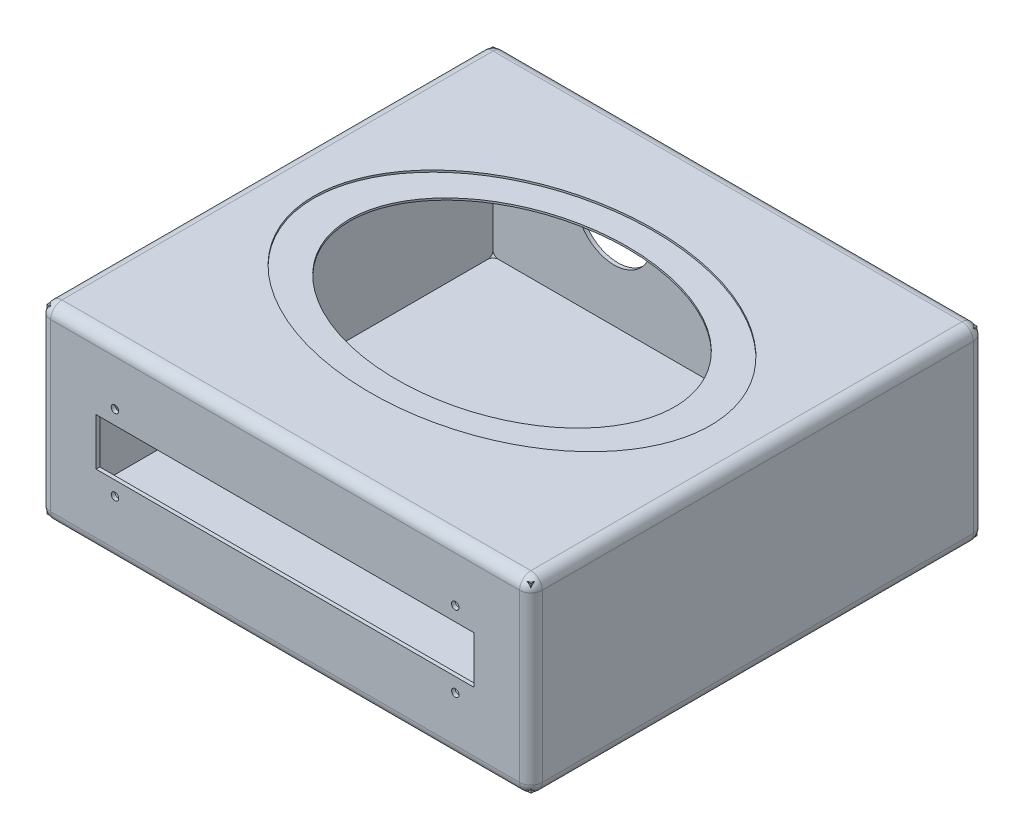
ISO-10303-21;
HEADER;
FILE_DESCRIPTION(('STEP AP214'),'2;1');
FILE_NAME('part.step','',(''),(''),'','','');
FILE_SCHEMA(('AUTOMOTIVE_DESIGN { 1 0 10303 214 1 1 1 1 }'));
ENDSEC;
DATA;
#1=APPLICATION_CONTEXT('core data for automotive mechanical design processes');
#2=APPLICATION_PROTOCOL_DEFINITION('international standard','automotive_design',2000,#1);
#3=PRODUCT_CONTEXT('',#1,'mechanical');
#4=PRODUCT('Part','Part','',(#3));
#5=PRODUCT_RELATED_PRODUCT_CATEGORY('part','',(#4));
#6=PRODUCT_DEFINITION_FORMATION('','',#4);
#7=PRODUCT_DEFINITION_CONTEXT('part definition',#1,'design');
#8=PRODUCT_DEFINITION('design','',#6,#7);
#9=PRODUCT_DEFINITION_SHAPE('','',#8);
#10=(LENGTH_UNIT() NAMED_UNIT(*) SI_UNIT(.MILLI.,.METRE.));
#11=(NAMED_UNIT(*) PLANE_ANGLE_UNIT() SI_UNIT($,.RADIAN.));
#12=(NAMED_UNIT(*) SI_UNIT($,.STERADIAN.) SOLID_ANGLE_UNIT());
#13=UNCERTAINTY_MEASURE_WITH_UNIT(LENGTH_MEASURE(1.E-05),#10,'distance_accuracy_value','');
#14=(GEOMETRIC_REPRESENTATION_CONTEXT(3) GLOBAL_UNCERTAINTY_ASSIGNED_CONTEXT((#13)) GLOBAL_UNIT_ASSIGNED_CONTEXT((#10,
#11,#12)) REPRESENTATION_CONTEXT('',''));
#15=CARTESIAN_POINT('',(0.,0.,0.));
#16=DIRECTION('',(0.,0.,1.));
#17=DIRECTION('',(1.,0.,0.));
#18=AXIS2_PLACEMENT_3D('',#15,#16,#17);
#19=CARTESIAN_POINT('',(114.3,38.1,149.86));
#20=DIRECTION('',(0.,0.,1.));
#21=DIRECTION('',(1.,0.,0.));
#22=AXIS2_PLACEMENT_3D('',#19,#20,#21);
#23=CYLINDRICAL_SURFACE('',#22,2.5);
#24=CARTESIAN_POINT('',(114.3,38.1,149.86));
#25=DIRECTION('',(0.,0.,1.));
#26=DIRECTION('',(1.,0.,0.));
#27=AXIS2_PLACEMENT_3D('',#24,#25,#26);
#28=CIRCLE('',#27,2.5);
#29=CARTESIAN_POINT('',(116.8,38.1,149.86));
#30=VERTEX_POINT('',#29);
#31=EDGE_CURVE('E47',#30,#30,#28,.T.);
#32=ORIENTED_EDGE('',*,*,#31,.F.);
#33=EDGE_LOOP('',(#32));
#34=FACE_BOUND('',#33,.T.);
#35=CARTESIAN_POINT('',(114.3,38.1,152.4));
#36=DIRECTION('',(0.,0.,1.));
#37=DIRECTION('',(1.,0.,0.));
#38=AXIS2_PLACEMENT_3D('',#35,#36,#37);
#39=CIRCLE('',#38,2.5);
#40=CARTESIAN_POINT('',(116.8,38.1,152.4));
#41=VERTEX_POINT('',#40);
#42=EDGE_CURVE('E12',#41,#41,#39,.T.);
#43=ORIENTED_EDGE('',*,*,#42,.T.);
#44=EDGE_LOOP('',(#43));
#45=FACE_BOUND('',#44,.T.);
#46=ADVANCED_FACE('F40',(#34,#45),#23,.F.);
#47=CARTESIAN_POINT('',(-114.3,38.1,149.86));
#48=DIRECTION('',(0.,0.,1.));
#49=DIRECTION('',(1.,0.,0.));
#50=AXIS2_PLACEMENT_3D('',#47,#48,#49);
#51=CYLINDRICAL_SURFACE('',#50,2.5);
#52=CARTESIAN_POINT('',(-114.3,38.1,149.86));
#53=DIRECTION('',(0.,0.,1.));
#54=DIRECTION('',(1.,0.,0.));
#55=AXIS2_PLACEMENT_3D('',#52,#53,#54);
#56=CIRCLE('',#55,2.5);
#57=CARTESIAN_POINT('',(-111.8,38.1,149.86));
#58=VERTEX_POINT('',#57);
#59=EDGE_CURVE('E375',#58,#58,#56,.T.);
#60=ORIENTED_EDGE('',*,*,#59,.F.);
#61=EDGE_LOOP('',(#60));
#62=FACE_BOUND('',#61,.T.);
#63=CARTESIAN_POINT('',(-114.3,38.1,152.4));
#64=DIRECTION('',(0.,0.,1.));
#65=DIRECTION('',(1.,0.,0.));
#66=AXIS2_PLACEMENT_3D('',#63,#64,#65);
#67=CIRCLE('',#66,2.5);
#68=CARTESIAN_POINT('',(-111.8,38.1,152.4));
#69=VERTEX_POINT('',#68);
#70=EDGE_CURVE('E385',#69,#69,#67,.T.);
#71=ORIENTED_EDGE('',*,*,#70,.T.);
#72=EDGE_LOOP('',(#71));
#73=FACE_BOUND('',#72,.T.);
#74=ADVANCED_FACE('F394',(#62,#73),#51,.F.);
#75=CARTESIAN_POINT('',(0.,101.6,0.));
#76=DIRECTION('',(0.,1.,0.));
#77=DIRECTION('',(-1.,0.,0.));
#78=AXIS2_PLACEMENT_3D('',#75,#76,#77);
#79=ELLIPSE('',#78,109.22,77.47);
#80=DIRECTION('',(0.,1.,0.));
#81=VECTOR('',#80,1.);
#82=SURFACE_OF_LINEAR_EXTRUSION('',#79,#81);
#83=CARTESIAN_POINT('',(0.,124.46,0.));
#84=DIRECTION('',(0.,1.,0.));
#85=DIRECTION('',(-1.,0.,0.));
#86=AXIS2_PLACEMENT_3D('',#83,#84,#85);
#87=ELLIPSE('',#86,109.22,77.47);
#88=CARTESIAN_POINT('',(-109.22,124.46,0.));
#89=VERTEX_POINT('',#88);
#90=EDGE_CURVE('E376',#89,#89,#87,.F.);
#91=ORIENTED_EDGE('',*,*,#90,.T.);
#92=EDGE_LOOP('',(#91));
#93=FACE_BOUND('',#92,.T.);
#94=CARTESIAN_POINT('',(0.,125.73,0.));
#95=DIRECTION('',(0.,1.,0.));
#96=DIRECTION('',(-1.,0.,0.));
#97=AXIS2_PLACEMENT_3D('',#94,#95,#96);
#98=ELLIPSE('',#97,109.22,77.47);
#99=CARTESIAN_POINT('',(-109.22,125.73,0.));
#100=VERTEX_POINT('',#99);
#101=EDGE_CURVE('E379',#100,#100,#98,.F.);
#102=ORIENTED_EDGE('',*,*,#101,.F.);
#103=EDGE_LOOP('',(#102));
#104=FACE_BOUND('',#103,.T.);
#105=ADVANCED_FACE('F422',(#93,#104),#82,.F.);
#106=CARTESIAN_POINT('',(165.1,127.,152.4));
#107=DIRECTION('',(-1.,0.,0.));
#108=DIRECTION('',(0.,0.,1.));
#109=AXIS2_PLACEMENT_3D('',#106,#107,#108);
#110=PLANE('',#109);
#111=DIRECTION('',(0.,-1.,0.));
#112=VECTOR('',#111,1.);
#113=CARTESIAN_POINT('',(165.1,127.,144.78));
#114=LINE('',#113,#112);
#115=CARTESIAN_POINT('',(165.1,119.38,144.78));
#116=VERTEX_POINT('',#115);
#117=CARTESIAN_POINT('',(165.1,7.62,144.78));
#118=VERTEX_POINT('',#117);
#119=EDGE_CURVE('E283',#116,#118,#114,.T.);
#120=ORIENTED_EDGE('',*,*,#119,.T.);
#121=DIRECTION('',(0.,0.,-1.));
#122=VECTOR('',#121,1.);
#123=CARTESIAN_POINT('',(165.1,7.62,-152.4));
#124=LINE('',#123,#122);
#125=CARTESIAN_POINT('',(165.1,7.62,-144.78));
#126=VERTEX_POINT('',#125);
#127=EDGE_CURVE('E286',#118,#126,#124,.T.);
#128=ORIENTED_EDGE('',*,*,#127,.T.);
#129=DIRECTION('',(0.,-1.,0.));
#130=VECTOR('',#129,1.);
#131=CARTESIAN_POINT('',(165.1,127.,-144.78));
#132=LINE('',#131,#130);
#133=CARTESIAN_POINT('',(165.1,119.38,-144.78));
#134=VERTEX_POINT('',#133);
#135=EDGE_CURVE('E281',#126,#134,#132,.F.);
#136=ORIENTED_EDGE('',*,*,#135,.T.);
#137=DIRECTION('',(0.,0.,-1.));
#138=VECTOR('',#137,1.);
#139=CARTESIAN_POINT('',(165.1,119.38,152.4));
#140=LINE('',#139,#138);
#141=EDGE_CURVE('E279',#134,#116,#140,.F.);
#142=ORIENTED_EDGE('',*,*,#141,.T.);
#143=EDGE_LOOP('',(#120,#128,#136,#142));
#144=FACE_BOUND('',#143,.T.);
#145=ADVANCED_FACE('F418',(#144),#110,.F.);
#146=CARTESIAN_POINT('',(-165.1,127.,-152.4));
#147=DIRECTION('',(0.,0.,1.));
#148=DIRECTION('',(1.,0.,0.));
#149=AXIS2_PLACEMENT_3D('',#146,#147,#148);
#150=PLANE('',#149);
#151=CARTESIAN_POINT('',(127.,50.8,-152.4));
#152=DIRECTION('',(0.,0.,-1.));
#153=DIRECTION('',(-1.,0.,0.));
#154=AXIS2_PLACEMENT_3D('',#151,#152,#153);
#155=CIRCLE('',#154,11.);
#156=CARTESIAN_POINT('',(116.,50.8,-152.4));
#157=VERTEX_POINT('',#156);
#158=EDGE_CURVE('E202',#157,#157,#155,.T.);
#159=ORIENTED_EDGE('',*,*,#158,.F.);
#160=EDGE_LOOP('',(#159));
#161=FACE_BOUND('',#160,.T.);
#162=CARTESIAN_POINT('',(-81.28,63.5,-152.4));
#163=DIRECTION('',(0.,0.,-1.));
#164=DIRECTION('',(-1.,0.,0.));
#165=AXIS2_PLACEMENT_3D('',#162,#163,#164);
#166=CIRCLE('',#165,25.4);
#167=CARTESIAN_POINT('',(-106.68,63.5,-152.4));
#168=VERTEX_POINT('',#167);
#169=EDGE_CURVE('E208',#168,#168,#166,.T.);
#170=ORIENTED_EDGE('',*,*,#169,.F.);
#171=EDGE_LOOP('',(#170));
#172=FACE_BOUND('',#171,.T.);
#173=DIRECTION('',(0.,-1.,0.));
#174=VECTOR('',#173,1.);
#175=CARTESIAN_POINT('',(157.48,127.,-152.4));
#176=LINE('',#175,#174);
#177=CARTESIAN_POINT('',(157.48,119.38,-152.4));
#178=VERTEX_POINT('',#177);
#179=CARTESIAN_POINT('',(157.48,7.62,-152.4));
#180=VERTEX_POINT('',#179);
#181=EDGE_CURVE('E245',#178,#180,#176,.T.);
#182=ORIENTED_EDGE('',*,*,#181,.T.);
#183=DIRECTION('',(-1.,0.,0.));
#184=VECTOR('',#183,1.);
#185=CARTESIAN_POINT('',(-165.1,7.62,-152.4));
#186=LINE('',#185,#184);
#187=CARTESIAN_POINT('',(-157.48,7.62,-152.4));
#188=VERTEX_POINT('',#187);
#189=EDGE_CURVE('E249',#180,#188,#186,.T.);
#190=ORIENTED_EDGE('',*,*,#189,.T.);
#191=DIRECTION('',(0.,-1.,0.));
#192=VECTOR('',#191,1.);
#193=CARTESIAN_POINT('',(-157.48,127.,-152.4));
#194=LINE('',#193,#192);
#195=CARTESIAN_POINT('',(-157.48,119.38,-152.4));
#196=VERTEX_POINT('',#195);
#197=EDGE_CURVE('E247',#188,#196,#194,.F.);
#198=ORIENTED_EDGE('',*,*,#197,.T.);
#199=DIRECTION('',(-1.,0.,0.));
#200=VECTOR('',#199,1.);
#201=CARTESIAN_POINT('',(-165.1,119.38,-152.4));
#202=LINE('',#201,#200);
#203=EDGE_CURVE('E214',#196,#178,#202,.F.);
#204=ORIENTED_EDGE('',*,*,#203,.T.);
#205=EDGE_LOOP('',(#182,#190,#198,#204));
#206=FACE_BOUND('',#205,.T.);
#207=ADVANCED_FACE('F409',(#161,#172,#206),#150,.F.);
#208=CARTESIAN_POINT('',(-165.1,127.,152.4));
#209=DIRECTION('',(1.,0.,0.));
#210=DIRECTION('',(0.,0.,-1.));
#211=AXIS2_PLACEMENT_3D('',#208,#209,#210);
#212=PLANE('',#211);
#213=DIRECTION('',(0.,-1.,0.));
#214=VECTOR('',#213,1.);
#215=CARTESIAN_POINT('',(-165.1,127.,-144.78));
#216=LINE('',#215,#214);
#217=CARTESIAN_POINT('',(-165.1,119.38,-144.78));
#218=VERTEX_POINT('',#217);
#219=CARTESIAN_POINT('',(-165.1,7.62,-144.78));
#220=VERTEX_POINT('',#219);
#221=EDGE_CURVE('E274',#218,#220,#216,.T.);
#222=ORIENTED_EDGE('',*,*,#221,.T.);
#223=DIRECTION('',(0.,0.,1.));
#224=VECTOR('',#223,1.);
#225=CARTESIAN_POINT('',(-165.1,7.62,152.4));
#226=LINE('',#225,#224);
#227=CARTESIAN_POINT('',(-165.1,7.62,144.78));
#228=VERTEX_POINT('',#227);
#229=EDGE_CURVE('E277',#220,#228,#226,.T.);
#230=ORIENTED_EDGE('',*,*,#229,.T.);
#231=DIRECTION('',(0.,-1.,0.));
#232=VECTOR('',#231,1.);
#233=CARTESIAN_POINT('',(-165.1,127.,144.78));
#234=LINE('',#233,#232);
#235=CARTESIAN_POINT('',(-165.1,119.38,144.78));
#236=VERTEX_POINT('',#235);
#237=EDGE_CURVE('E272',#228,#236,#234,.F.);
#238=ORIENTED_EDGE('',*,*,#237,.T.);
#239=DIRECTION('',(0.,0.,1.));
#240=VECTOR('',#239,1.);
#241=CARTESIAN_POINT('',(-165.1,119.38,152.4));
#242=LINE('',#241,#240);
#243=EDGE_CURVE('E270',#236,#218,#242,.F.);
#244=ORIENTED_EDGE('',*,*,#243,.T.);
#245=EDGE_LOOP('',(#222,#230,#238,#244));
#246=FACE_BOUND('',#245,.T.);
#247=ADVANCED_FACE('F399',(#246),#212,.F.);
#248=CARTESIAN_POINT('',(-165.1,127.,152.4));
#249=DIRECTION('',(0.,0.,-1.));
#250=DIRECTION('',(-1.,0.,0.));
#251=AXIS2_PLACEMENT_3D('',#248,#249,#250);
#252=PLANE('',#251);
#253=CARTESIAN_POINT('',(114.3,88.9,152.4));
#254=DIRECTION('',(0.,0.,1.));
#255=DIRECTION('',(1.,0.,0.));
#256=AXIS2_PLACEMENT_3D('',#253,#254,#255);
#257=CIRCLE('',#256,2.5);
#258=CARTESIAN_POINT('',(116.8,88.9,152.4));
#259=VERTEX_POINT('',#258);
#260=EDGE_CURVE('E562',#259,#259,#257,.T.);
#261=ORIENTED_EDGE('',*,*,#260,.F.);
#262=EDGE_LOOP('',(#261));
#263=FACE_BOUND('',#262,.T.);
#264=CARTESIAN_POINT('',(-114.3,88.9,152.4));
#265=DIRECTION('',(0.,0.,1.));
#266=DIRECTION('',(1.,0.,0.));
#267=AXIS2_PLACEMENT_3D('',#264,#265,#266);
#268=CIRCLE('',#267,2.5);
#269=CARTESIAN_POINT('',(-111.8,88.9,152.4));
#270=VERTEX_POINT('',#269);
#271=EDGE_CURVE('E559',#270,#270,#268,.T.);
#272=ORIENTED_EDGE('',*,*,#271,.F.);
#273=EDGE_LOOP('',(#272));
#274=FACE_BOUND('',#273,.T.);
#275=DIRECTION('',(-1.,0.,0.));
#276=VECTOR('',#275,1.);
#277=CARTESIAN_POINT('',(-127.,79.375,152.4));
#278=LINE('',#277,#276);
#279=CARTESIAN_POINT('',(127.,79.375,152.4));
#280=VERTEX_POINT('',#279);
#281=CARTESIAN_POINT('',(-127.,79.375,152.4));
#282=VERTEX_POINT('',#281);
#283=EDGE_CURVE('E188',#280,#282,#278,.T.);
#284=ORIENTED_EDGE('',*,*,#283,.F.);
#285=DIRECTION('',(0.,1.,0.));
#286=VECTOR('',#285,1.);
#287=CARTESIAN_POINT('',(127.,47.625,152.4));
#288=LINE('',#287,#286);
#289=CARTESIAN_POINT('',(127.,47.625,152.4));
#290=VERTEX_POINT('',#289);
#291=EDGE_CURVE('E54',#290,#280,#288,.T.);
#292=ORIENTED_EDGE('',*,*,#291,.F.);
#293=DIRECTION('',(1.,0.,0.));
#294=VECTOR('',#293,1.);
#295=CARTESIAN_POINT('',(-127.,47.625,152.4));
#296=LINE('',#295,#294);
#297=CARTESIAN_POINT('',(-127.,47.625,152.4));
#298=VERTEX_POINT('',#297);
#299=EDGE_CURVE('E195',#298,#290,#296,.T.);
#300=ORIENTED_EDGE('',*,*,#299,.F.);
#301=DIRECTION('',(0.,-1.,0.));
#302=VECTOR('',#301,1.);
#303=CARTESIAN_POINT('',(-127.,47.625,152.4));
#304=LINE('',#303,#302);
#305=EDGE_CURVE('E179',#282,#298,#304,.T.);
#306=ORIENTED_EDGE('',*,*,#305,.F.);
#307=EDGE_LOOP('',(#284,#292,#300,#306));
#308=FACE_BOUND('',#307,.T.);
#309=DIRECTION('',(0.,-1.,0.));
#310=VECTOR('',#309,1.);
#311=CARTESIAN_POINT('',(-157.48,127.,152.4));
#312=LINE('',#311,#310);
#313=CARTESIAN_POINT('',(-157.48,119.38,152.4));
#314=VERTEX_POINT('',#313);
#315=CARTESIAN_POINT('',(-157.48,7.62,152.4));
#316=VERTEX_POINT('',#315);
#317=EDGE_CURVE('E265',#314,#316,#312,.T.);
#318=ORIENTED_EDGE('',*,*,#317,.T.);
#319=DIRECTION('',(1.,0.,0.));
#320=VECTOR('',#319,1.);
#321=CARTESIAN_POINT('',(165.1,7.62,152.4));
#322=LINE('',#321,#320);
#323=CARTESIAN_POINT('',(157.48,7.62,152.4));
#324=VERTEX_POINT('',#323);
#325=EDGE_CURVE('E267',#316,#324,#322,.T.);
#326=ORIENTED_EDGE('',*,*,#325,.T.);
#327=DIRECTION('',(0.,-1.,0.));
#328=VECTOR('',#327,1.);
#329=CARTESIAN_POINT('',(157.48,127.,152.4));
#330=LINE('',#329,#328);
#331=CARTESIAN_POINT('',(157.48,119.38,152.4));
#332=VERTEX_POINT('',#331);
#333=EDGE_CURVE('E263',#324,#332,#330,.F.);
#334=ORIENTED_EDGE('',*,*,#333,.T.);
#335=DIRECTION('',(1.,0.,0.));
#336=VECTOR('',#335,1.);
#337=CARTESIAN_POINT('',(-165.1,119.38,152.4));
#338=LINE('',#337,#336);
#339=EDGE_CURVE('E261',#332,#314,#338,.F.);
#340=ORIENTED_EDGE('',*,*,#339,.T.);
#341=EDGE_LOOP('',(#318,#326,#334,#340));
#342=FACE_BOUND('',#341,.T.);
#343=ORIENTED_EDGE('',*,*,#70,.F.);
#344=EDGE_LOOP('',(#343));
#345=FACE_BOUND('',#344,.T.);
#346=ORIENTED_EDGE('',*,*,#42,.F.);
#347=EDGE_LOOP('',(#346));
#348=FACE_BOUND('',#347,.T.);
#349=ADVANCED_FACE('F192',(#263,#274,#308,#342,#345,#348),#252,.F.);
#350=CARTESIAN_POINT('',(0.,127.,0.));
#351=DIRECTION('',(0.,-1.,0.));
#352=DIRECTION('',(0.,0.,-1.));
#353=AXIS2_PLACEMENT_3D('',#350,#351,#352);
#354=PLANE('',#353);
#355=CARTESIAN_POINT('',(0.,127.,0.));
#356=DIRECTION('',(0.,1.,0.));
#357=DIRECTION('',(-1.,0.,0.));
#358=AXIS2_PLACEMENT_3D('',#355,#356,#357);
#359=ELLIPSE('',#358,133.35,95.25);
#360=CARTESIAN_POINT('',(-133.35,127.,0.));
#361=VERTEX_POINT('',#360);
#362=EDGE_CURVE('E553',#361,#361,#359,.T.);
#363=ORIENTED_EDGE('',*,*,#362,.F.);
#364=EDGE_LOOP('',(#363));
#365=FACE_BOUND('',#364,.T.);
#366=DIRECTION('',(0.,0.,1.));
#367=VECTOR('',#366,1.);
#368=CARTESIAN_POINT('',(-157.48,127.,0.));
#369=LINE('',#368,#367);
#370=CARTESIAN_POINT('',(-157.48,127.,-144.78));
#371=VERTEX_POINT('',#370);
#372=CARTESIAN_POINT('',(-157.48,127.,144.78));
#373=VERTEX_POINT('',#372);
#374=EDGE_CURVE('E292',#371,#373,#369,.T.);
#375=ORIENTED_EDGE('',*,*,#374,.T.);
#376=DIRECTION('',(1.,0.,0.));
#377=VECTOR('',#376,1.);
#378=CARTESIAN_POINT('',(0.,127.,144.78));
#379=LINE('',#378,#377);
#380=CARTESIAN_POINT('',(157.48,127.,144.78));
#381=VERTEX_POINT('',#380);
#382=EDGE_CURVE('E294',#373,#381,#379,.T.);
#383=ORIENTED_EDGE('',*,*,#382,.T.);
#384=DIRECTION('',(0.,0.,-1.));
#385=VECTOR('',#384,1.);
#386=CARTESIAN_POINT('',(157.48,127.,0.));
#387=LINE('',#386,#385);
#388=CARTESIAN_POINT('',(157.48,127.,-144.78));
#389=VERTEX_POINT('',#388);
#390=EDGE_CURVE('E288',#381,#389,#387,.T.);
#391=ORIENTED_EDGE('',*,*,#390,.T.);
#392=DIRECTION('',(-1.,0.,0.));
#393=VECTOR('',#392,1.);
#394=CARTESIAN_POINT('',(0.,127.,-144.78));
#395=LINE('',#394,#393);
#396=EDGE_CURVE('E290',#389,#371,#395,.T.);
#397=ORIENTED_EDGE('',*,*,#396,.T.);
#398=EDGE_LOOP('',(#375,#383,#391,#397));
#399=FACE_BOUND('',#398,.T.);
#400=ADVANCED_FACE('F398',(#365,#399),#354,.F.);
#401=CARTESIAN_POINT('',(0.,0.,0.));
#402=DIRECTION('',(0.,-1.,0.));
#403=DIRECTION('',(0.,0.,-1.));
#404=AXIS2_PLACEMENT_3D('',#401,#402,#403);
#405=PLANE('',#404);
#406=DIRECTION('',(1.,0.,0.));
#407=VECTOR('',#406,1.);
#408=CARTESIAN_POINT('',(-165.1,0.,144.78));
#409=LINE('',#408,#407);
#410=CARTESIAN_POINT('',(157.48,0.,144.78));
#411=VERTEX_POINT('',#410);
#412=CARTESIAN_POINT('',(-157.48,0.,144.78));
#413=VERTEX_POINT('',#412);
#414=EDGE_CURVE('E254',#411,#413,#409,.F.);
#415=ORIENTED_EDGE('',*,*,#414,.T.);
#416=DIRECTION('',(0.,0.,1.));
#417=VECTOR('',#416,1.);
#418=CARTESIAN_POINT('',(-157.48,0.,-152.4));
#419=LINE('',#418,#417);
#420=CARTESIAN_POINT('',(-157.48,0.,-144.78));
#421=VERTEX_POINT('',#420);
#422=EDGE_CURVE('E259',#413,#421,#419,.F.);
#423=ORIENTED_EDGE('',*,*,#422,.T.);
#424=DIRECTION('',(-1.,0.,0.));
#425=VECTOR('',#424,1.);
#426=CARTESIAN_POINT('',(165.1,0.,-144.78));
#427=LINE('',#426,#425);
#428=CARTESIAN_POINT('',(157.48,0.,-144.78));
#429=VERTEX_POINT('',#428);
#430=EDGE_CURVE('E256',#421,#429,#427,.F.);
#431=ORIENTED_EDGE('',*,*,#430,.T.);
#432=DIRECTION('',(0.,0.,-1.));
#433=VECTOR('',#432,1.);
#434=CARTESIAN_POINT('',(157.48,0.,152.4));
#435=LINE('',#434,#433);
#436=EDGE_CURVE('E252',#429,#411,#435,.F.);
#437=ORIENTED_EDGE('',*,*,#436,.T.);
#438=EDGE_LOOP('',(#415,#423,#431,#437));
#439=FACE_BOUND('',#438,.T.);
#440=ADVANCED_FACE('F406',(#439),#405,.T.);
#441=CARTESIAN_POINT('',(0.,119.38,144.78));
#442=DIRECTION('',(1.,0.,0.));
#443=DIRECTION('',(0.,0.,-1.));
#444=AXIS2_PLACEMENT_3D('',#441,#442,#443);
#445=CYLINDRICAL_SURFACE('',#444,7.62);
#446=CARTESIAN_POINT('',(157.48,119.38,144.78));
#447=DIRECTION('',(1.,0.,0.));
#448=DIRECTION('',(0.,0.,-1.));
#449=AXIS2_PLACEMENT_3D('',#446,#447,#448);
#450=CIRCLE('',#449,7.62);
#451=EDGE_CURVE('E243',#381,#332,#450,.T.);
#452=ORIENTED_EDGE('',*,*,#451,.F.);
#453=ORIENTED_EDGE('',*,*,#382,.F.);
#454=CARTESIAN_POINT('',(-157.48,119.38,144.78));
#455=DIRECTION('',(-1.,0.,0.));
#456=DIRECTION('',(0.,0.,1.));
#457=AXIS2_PLACEMENT_3D('',#454,#455,#456);
#458=CIRCLE('',#457,7.62);
#459=EDGE_CURVE('E360',#314,#373,#458,.T.);
#460=ORIENTED_EDGE('',*,*,#459,.F.);
#461=ORIENTED_EDGE('',*,*,#339,.F.);
#462=EDGE_LOOP('',(#452,#453,#460,#461));
#463=FACE_BOUND('',#462,.T.);
#464=ADVANCED_FACE('F524',(#463),#445,.T.);
#465=CARTESIAN_POINT('',(157.48,119.38,144.78));
#466=DIRECTION('',(0.,0.,1.));
#467=DIRECTION('',(1.,0.,0.));
#468=AXIS2_PLACEMENT_3D('',#465,#466,#467);
#469=SPHERICAL_SURFACE('',#468,7.62);
#470=CARTESIAN_POINT('',(157.48,119.38,144.78));
#471=DIRECTION('',(0.,0.,1.));
#472=DIRECTION('',(1.,0.,0.));
#473=AXIS2_PLACEMENT_3D('',#470,#471,#472);
#474=CIRCLE('',#473,7.62);
#475=EDGE_CURVE('E354',#381,#116,#474,.F.);
#476=ORIENTED_EDGE('',*,*,#475,.F.);
#477=ORIENTED_EDGE('',*,*,#451,.T.);
#478=CARTESIAN_POINT('',(157.48,119.38,144.78));
#479=DIRECTION('',(0.,1.,0.));
#480=DIRECTION('',(0.,0.,1.));
#481=AXIS2_PLACEMENT_3D('',#478,#479,#480);
#482=CIRCLE('',#481,7.62);
#483=EDGE_CURVE('E357',#116,#332,#482,.F.);
#484=ORIENTED_EDGE('',*,*,#483,.F.);
#485=EDGE_LOOP('',(#476,#477,#484));
#486=FACE_BOUND('',#485,.T.);
#487=ADVANCED_FACE('F520',(#486),#469,.T.);
#488=CARTESIAN_POINT('',(-157.48,119.38,144.78));
#489=DIRECTION('',(0.,1.,0.));
#490=DIRECTION('',(0.,0.,1.));
#491=AXIS2_PLACEMENT_3D('',#488,#489,#490);
#492=SPHERICAL_SURFACE('',#491,7.62);
#493=CARTESIAN_POINT('',(-157.48,119.38,144.78));
#494=DIRECTION('',(0.,1.,0.));
#495=DIRECTION('',(0.,0.,1.));
#496=AXIS2_PLACEMENT_3D('',#493,#494,#495);
#497=CIRCLE('',#496,7.62);
#498=EDGE_CURVE('E348',#314,#236,#497,.F.);
#499=ORIENTED_EDGE('',*,*,#498,.F.);
#500=ORIENTED_EDGE('',*,*,#459,.T.);
#501=CARTESIAN_POINT('',(-157.48,119.38,144.78));
#502=DIRECTION('',(0.,0.,1.));
#503=DIRECTION('',(1.,0.,0.));
#504=AXIS2_PLACEMENT_3D('',#501,#502,#503);
#505=CIRCLE('',#504,7.62);
#506=EDGE_CURVE('E351',#236,#373,#505,.F.);
#507=ORIENTED_EDGE('',*,*,#506,.F.);
#508=EDGE_LOOP('',(#499,#500,#507));
#509=FACE_BOUND('',#508,.T.);
#510=ADVANCED_FACE('F516',(#509),#492,.T.);
#511=CARTESIAN_POINT('',(157.48,127.,144.78));
#512=DIRECTION('',(0.,-1.,0.));
#513=DIRECTION('',(0.,0.,-1.));
#514=AXIS2_PLACEMENT_3D('',#511,#512,#513);
#515=CYLINDRICAL_SURFACE('',#514,7.62);
#516=ORIENTED_EDGE('',*,*,#483,.T.);
#517=ORIENTED_EDGE('',*,*,#333,.F.);
#518=CARTESIAN_POINT('',(157.48,7.62,144.78));
#519=DIRECTION('',(0.,-1.,0.));
#520=DIRECTION('',(0.,0.,-1.));
#521=AXIS2_PLACEMENT_3D('',#518,#519,#520);
#522=CIRCLE('',#521,7.62);
#523=EDGE_CURVE('E343',#118,#324,#522,.T.);
#524=ORIENTED_EDGE('',*,*,#523,.F.);
#525=ORIENTED_EDGE('',*,*,#119,.F.);
#526=EDGE_LOOP('',(#516,#517,#524,#525));
#527=FACE_BOUND('',#526,.T.);
#528=ADVANCED_FACE('F512',(#527),#515,.T.);
#529=CARTESIAN_POINT('',(157.48,119.38,0.));
#530=DIRECTION('',(0.,0.,-1.));
#531=DIRECTION('',(-1.,0.,0.));
#532=AXIS2_PLACEMENT_3D('',#529,#530,#531);
#533=CYLINDRICAL_SURFACE('',#532,7.62);
#534=ORIENTED_EDGE('',*,*,#475,.T.);
#535=ORIENTED_EDGE('',*,*,#141,.F.);
#536=CARTESIAN_POINT('',(157.48,119.38,-144.78));
#537=DIRECTION('',(0.,0.,-1.));
#538=DIRECTION('',(-1.,0.,0.));
#539=AXIS2_PLACEMENT_3D('',#536,#537,#538);
#540=CIRCLE('',#539,7.62);
#541=EDGE_CURVE('E340',#389,#134,#540,.T.);
#542=ORIENTED_EDGE('',*,*,#541,.F.);
#543=ORIENTED_EDGE('',*,*,#390,.F.);
#544=EDGE_LOOP('',(#534,#535,#542,#543));
#545=FACE_BOUND('',#544,.T.);
#546=ADVANCED_FACE('F508',(#545),#533,.T.);
#547=CARTESIAN_POINT('',(0.,119.38,-144.78));
#548=DIRECTION('',(-1.,0.,0.));
#549=DIRECTION('',(0.,0.,1.));
#550=AXIS2_PLACEMENT_3D('',#547,#548,#549);
#551=CYLINDRICAL_SURFACE('',#550,7.62);
#552=CARTESIAN_POINT('',(-157.48,119.38,-144.78));
#553=DIRECTION('',(-1.,0.,0.));
#554=DIRECTION('',(0.,0.,1.));
#555=AXIS2_PLACEMENT_3D('',#552,#553,#554);
#556=CIRCLE('',#555,7.62);
#557=EDGE_CURVE('E334',#371,#196,#556,.T.);
#558=ORIENTED_EDGE('',*,*,#557,.F.);
#559=ORIENTED_EDGE('',*,*,#396,.F.);
#560=CARTESIAN_POINT('',(157.48,119.38,-144.78));
#561=DIRECTION('',(1.,0.,0.));
#562=DIRECTION('',(0.,1.,0.));
#563=AXIS2_PLACEMENT_3D('',#560,#561,#562);
#564=CIRCLE('',#563,7.62);
#565=EDGE_CURVE('E337',#178,#389,#564,.T.);
#566=ORIENTED_EDGE('',*,*,#565,.F.);
#567=ORIENTED_EDGE('',*,*,#203,.F.);
#568=EDGE_LOOP('',(#558,#559,#566,#567));
#569=FACE_BOUND('',#568,.T.);
#570=ADVANCED_FACE('F504',(#569),#551,.T.);
#571=CARTESIAN_POINT('',(-157.48,119.38,0.));
#572=DIRECTION('',(0.,0.,1.));
#573=DIRECTION('',(1.,0.,0.));
#574=AXIS2_PLACEMENT_3D('',#571,#572,#573);
#575=CYLINDRICAL_SURFACE('',#574,7.62);
#576=ORIENTED_EDGE('',*,*,#506,.T.);
#577=ORIENTED_EDGE('',*,*,#374,.F.);
#578=CARTESIAN_POINT('',(-157.48,119.38,-144.78));
#579=DIRECTION('',(0.,0.,-1.));
#580=DIRECTION('',(0.,1.,0.));
#581=AXIS2_PLACEMENT_3D('',#578,#579,#580);
#582=CIRCLE('',#581,7.62);
#583=EDGE_CURVE('E331',#218,#371,#582,.T.);
#584=ORIENTED_EDGE('',*,*,#583,.F.);
#585=ORIENTED_EDGE('',*,*,#243,.F.);
#586=EDGE_LOOP('',(#576,#577,#584,#585));
#587=FACE_BOUND('',#586,.T.);
#588=ADVANCED_FACE('F500',(#587),#575,.T.);
#589=CARTESIAN_POINT('',(-157.48,127.,144.78));
#590=DIRECTION('',(0.,-1.,0.));
#591=DIRECTION('',(0.,0.,-1.));
#592=AXIS2_PLACEMENT_3D('',#589,#590,#591);
#593=CYLINDRICAL_SURFACE('',#592,7.62);
#594=ORIENTED_EDGE('',*,*,#498,.T.);
#595=ORIENTED_EDGE('',*,*,#237,.F.);
#596=CARTESIAN_POINT('',(-157.48,7.62,144.78));
#597=DIRECTION('',(0.,-1.,0.));
#598=DIRECTION('',(0.,0.,-1.));
#599=AXIS2_PLACEMENT_3D('',#596,#597,#598);
#600=CIRCLE('',#599,7.62);
#601=EDGE_CURVE('E328',#316,#228,#600,.T.);
#602=ORIENTED_EDGE('',*,*,#601,.F.);
#603=ORIENTED_EDGE('',*,*,#317,.F.);
#604=EDGE_LOOP('',(#594,#595,#602,#603));
#605=FACE_BOUND('',#604,.T.);
#606=ADVANCED_FACE('F496',(#605),#593,.T.);
#607=CARTESIAN_POINT('',(-165.1,7.62,144.78));
#608=DIRECTION('',(-1.,0.,0.));
#609=DIRECTION('',(0.,0.,1.));
#610=AXIS2_PLACEMENT_3D('',#607,#608,#609);
#611=CYLINDRICAL_SURFACE('',#610,7.62);
#612=CARTESIAN_POINT('',(157.48,7.62,144.78));
#613=DIRECTION('',(1.,0.,0.));
#614=DIRECTION('',(0.,0.,-1.));
#615=AXIS2_PLACEMENT_3D('',#612,#613,#614);
#616=CIRCLE('',#615,7.62);
#617=EDGE_CURVE('E345',#324,#411,#616,.T.);
#618=ORIENTED_EDGE('',*,*,#617,.F.);
#619=ORIENTED_EDGE('',*,*,#325,.F.);
#620=CARTESIAN_POINT('',(-157.48,7.62,144.78));
#621=DIRECTION('',(-1.,0.,0.));
#622=DIRECTION('',(0.,0.,1.));
#623=AXIS2_PLACEMENT_3D('',#620,#621,#622);
#624=CIRCLE('',#623,7.62);
#625=EDGE_CURVE('E325',#413,#316,#624,.T.);
#626=ORIENTED_EDGE('',*,*,#625,.F.);
#627=ORIENTED_EDGE('',*,*,#414,.F.);
#628=EDGE_LOOP('',(#618,#619,#626,#627));
#629=FACE_BOUND('',#628,.T.);
#630=ADVANCED_FACE('F492',(#629),#611,.T.);
#631=CARTESIAN_POINT('',(157.48,7.62,144.78));
#632=DIRECTION('',(0.,0.,1.));
#633=DIRECTION('',(0.,-1.,0.));
#634=AXIS2_PLACEMENT_3D('',#631,#632,#633);
#635=SPHERICAL_SURFACE('',#634,7.62);
#636=ORIENTED_EDGE('',*,*,#523,.T.);
#637=ORIENTED_EDGE('',*,*,#617,.T.);
#638=CARTESIAN_POINT('',(157.48,7.62,144.78));
#639=DIRECTION('',(0.,0.,1.));
#640=DIRECTION('',(1.,0.,0.));
#641=AXIS2_PLACEMENT_3D('',#638,#639,#640);
#642=CIRCLE('',#641,7.62);
#643=EDGE_CURVE('E322',#118,#411,#642,.F.);
#644=ORIENTED_EDGE('',*,*,#643,.F.);
#645=EDGE_LOOP('',(#636,#637,#644));
#646=FACE_BOUND('',#645,.T.);
#647=ADVANCED_FACE('F488',(#646),#635,.T.);
#648=CARTESIAN_POINT('',(157.48,119.38,-144.78));
#649=DIRECTION('',(0.,1.,0.));
#650=DIRECTION('',(0.,0.,1.));
#651=AXIS2_PLACEMENT_3D('',#648,#649,#650);
#652=SPHERICAL_SURFACE('',#651,7.62);
#653=ORIENTED_EDGE('',*,*,#565,.T.);
#654=ORIENTED_EDGE('',*,*,#541,.T.);
#655=CARTESIAN_POINT('',(157.48,119.38,-144.78));
#656=DIRECTION('',(0.,1.,0.));
#657=DIRECTION('',(0.,0.,1.));
#658=AXIS2_PLACEMENT_3D('',#655,#656,#657);
#659=CIRCLE('',#658,7.62);
#660=EDGE_CURVE('E319',#178,#134,#659,.F.);
#661=ORIENTED_EDGE('',*,*,#660,.F.);
#662=EDGE_LOOP('',(#653,#654,#661));
#663=FACE_BOUND('',#662,.T.);
#664=ADVANCED_FACE('F484',(#663),#652,.T.);
#665=CARTESIAN_POINT('',(-157.48,119.38,-144.78));
#666=DIRECTION('',(0.,1.,0.));
#667=DIRECTION('',(0.,0.,1.));
#668=AXIS2_PLACEMENT_3D('',#665,#666,#667);
#669=SPHERICAL_SURFACE('',#668,7.62);
#670=ORIENTED_EDGE('',*,*,#583,.T.);
#671=ORIENTED_EDGE('',*,*,#557,.T.);
#672=CARTESIAN_POINT('',(-157.48,119.38,-144.78));
#673=DIRECTION('',(0.,1.,0.));
#674=DIRECTION('',(0.,0.,1.));
#675=AXIS2_PLACEMENT_3D('',#672,#673,#674);
#676=CIRCLE('',#675,7.62);
#677=EDGE_CURVE('E316',#218,#196,#676,.F.);
#678=ORIENTED_EDGE('',*,*,#677,.F.);
#679=EDGE_LOOP('',(#670,#671,#678));
#680=FACE_BOUND('',#679,.T.);
#681=ADVANCED_FACE('F480',(#680),#669,.T.);
#682=CARTESIAN_POINT('',(-157.48,7.62,144.78));
#683=DIRECTION('',(0.,0.,1.));
#684=DIRECTION('',(0.,-1.,0.));
#685=AXIS2_PLACEMENT_3D('',#682,#683,#684);
#686=SPHERICAL_SURFACE('',#685,7.62);
#687=ORIENTED_EDGE('',*,*,#625,.T.);
#688=ORIENTED_EDGE('',*,*,#601,.T.);
#689=CARTESIAN_POINT('',(-157.48,7.62,144.78));
#690=DIRECTION('',(0.,0.,1.));
#691=DIRECTION('',(1.,0.,0.));
#692=AXIS2_PLACEMENT_3D('',#689,#690,#691);
#693=CIRCLE('',#692,7.62);
#694=EDGE_CURVE('E313',#413,#228,#693,.F.);
#695=ORIENTED_EDGE('',*,*,#694,.F.);
#696=EDGE_LOOP('',(#687,#688,#695));
#697=FACE_BOUND('',#696,.T.);
#698=ADVANCED_FACE('F476',(#697),#686,.T.);
#699=CARTESIAN_POINT('',(157.48,7.62,152.4));
#700=DIRECTION('',(0.,0.,1.));
#701=DIRECTION('',(1.,0.,0.));
#702=AXIS2_PLACEMENT_3D('',#699,#700,#701);
#703=CYLINDRICAL_SURFACE('',#702,7.62);
#704=ORIENTED_EDGE('',*,*,#643,.T.);
#705=ORIENTED_EDGE('',*,*,#436,.F.);
#706=CARTESIAN_POINT('',(157.48,7.62,-144.78));
#707=DIRECTION('',(0.,0.,-1.));
#708=DIRECTION('',(-1.,0.,0.));
#709=AXIS2_PLACEMENT_3D('',#706,#707,#708);
#710=CIRCLE('',#709,7.62);
#711=EDGE_CURVE('E310',#126,#429,#710,.T.);
#712=ORIENTED_EDGE('',*,*,#711,.F.);
#713=ORIENTED_EDGE('',*,*,#127,.F.);
#714=EDGE_LOOP('',(#704,#705,#712,#713));
#715=FACE_BOUND('',#714,.T.);
#716=ADVANCED_FACE('F472',(#715),#703,.T.);
#717=CARTESIAN_POINT('',(157.48,127.,-144.78));
#718=DIRECTION('',(0.,-1.,0.));
#719=DIRECTION('',(0.,0.,-1.));
#720=AXIS2_PLACEMENT_3D('',#717,#718,#719);
#721=CYLINDRICAL_SURFACE('',#720,7.62);
#722=ORIENTED_EDGE('',*,*,#660,.T.);
#723=ORIENTED_EDGE('',*,*,#135,.F.);
#724=CARTESIAN_POINT('',(157.48,7.62,-144.78));
#725=DIRECTION('',(0.,-1.,0.));
#726=DIRECTION('',(0.,0.,-1.));
#727=AXIS2_PLACEMENT_3D('',#724,#725,#726);
#728=CIRCLE('',#727,7.62);
#729=EDGE_CURVE('E307',#180,#126,#728,.T.);
#730=ORIENTED_EDGE('',*,*,#729,.F.);
#731=ORIENTED_EDGE('',*,*,#181,.F.);
#732=EDGE_LOOP('',(#722,#723,#730,#731));
#733=FACE_BOUND('',#732,.T.);
#734=ADVANCED_FACE('F468',(#733),#721,.T.);
#735=CARTESIAN_POINT('',(-157.48,127.,-144.78));
#736=DIRECTION('',(0.,-1.,0.));
#737=DIRECTION('',(0.,0.,-1.));
#738=AXIS2_PLACEMENT_3D('',#735,#736,#737);
#739=CYLINDRICAL_SURFACE('',#738,7.62);
#740=ORIENTED_EDGE('',*,*,#677,.T.);
#741=ORIENTED_EDGE('',*,*,#197,.F.);
#742=CARTESIAN_POINT('',(-157.48,7.62,-144.78));
#743=DIRECTION('',(0.,-1.,0.));
#744=DIRECTION('',(0.,0.,-1.));
#745=AXIS2_PLACEMENT_3D('',#742,#743,#744);
#746=CIRCLE('',#745,7.62);
#747=EDGE_CURVE('E304',#220,#188,#746,.T.);
#748=ORIENTED_EDGE('',*,*,#747,.F.);
#749=ORIENTED_EDGE('',*,*,#221,.F.);
#750=EDGE_LOOP('',(#740,#741,#748,#749));
#751=FACE_BOUND('',#750,.T.);
#752=ADVANCED_FACE('F464',(#751),#739,.T.);
#753=CARTESIAN_POINT('',(-157.48,7.62,152.4));
#754=DIRECTION('',(0.,0.,-1.));
#755=DIRECTION('',(-1.,0.,0.));
#756=AXIS2_PLACEMENT_3D('',#753,#754,#755);
#757=CYLINDRICAL_SURFACE('',#756,7.62);
#758=ORIENTED_EDGE('',*,*,#694,.T.);
#759=ORIENTED_EDGE('',*,*,#229,.F.);
#760=CARTESIAN_POINT('',(-157.48,7.62,-144.78));
#761=DIRECTION('',(0.,0.,-1.));
#762=DIRECTION('',(-1.,0.,0.));
#763=AXIS2_PLACEMENT_3D('',#760,#761,#762);
#764=CIRCLE('',#763,7.62);
#765=EDGE_CURVE('E302',#421,#220,#764,.T.);
#766=ORIENTED_EDGE('',*,*,#765,.F.);
#767=ORIENTED_EDGE('',*,*,#422,.F.);
#768=EDGE_LOOP('',(#758,#759,#766,#767));
#769=FACE_BOUND('',#768,.T.);
#770=ADVANCED_FACE('F460',(#769),#757,.T.);
#771=CARTESIAN_POINT('',(157.48,7.62,-144.78));
#772=DIRECTION('',(1.,0.,0.));
#773=DIRECTION('',(0.,1.,0.));
#774=AXIS2_PLACEMENT_3D('',#771,#772,#773);
#775=SPHERICAL_SURFACE('',#774,7.62);
#776=ORIENTED_EDGE('',*,*,#729,.T.);
#777=ORIENTED_EDGE('',*,*,#711,.T.);
#778=CARTESIAN_POINT('',(157.48,7.62,-144.78));
#779=DIRECTION('',(1.,0.,0.));
#780=DIRECTION('',(0.,0.,-1.));
#781=AXIS2_PLACEMENT_3D('',#778,#779,#780);
#782=CIRCLE('',#781,7.62);
#783=EDGE_CURVE('E300',#180,#429,#782,.F.);
#784=ORIENTED_EDGE('',*,*,#783,.F.);
#785=EDGE_LOOP('',(#776,#777,#784));
#786=FACE_BOUND('',#785,.T.);
#787=ADVANCED_FACE('F456',(#786),#775,.T.);
#788=CARTESIAN_POINT('',(-157.48,7.62,-144.78));
#789=DIRECTION('',(-1.,0.,0.));
#790=DIRECTION('',(0.,0.,1.));
#791=AXIS2_PLACEMENT_3D('',#788,#789,#790);
#792=SPHERICAL_SURFACE('',#791,7.62);
#793=ORIENTED_EDGE('',*,*,#765,.T.);
#794=ORIENTED_EDGE('',*,*,#747,.T.);
#795=CARTESIAN_POINT('',(-157.48,7.62,-144.78));
#796=DIRECTION('',(-1.,0.,0.));
#797=DIRECTION('',(0.,0.,1.));
#798=AXIS2_PLACEMENT_3D('',#795,#796,#797);
#799=CIRCLE('',#798,7.62);
#800=EDGE_CURVE('E298',#421,#188,#799,.F.);
#801=ORIENTED_EDGE('',*,*,#800,.F.);
#802=EDGE_LOOP('',(#793,#794,#801));
#803=FACE_BOUND('',#802,.T.);
#804=ADVANCED_FACE('F452',(#803),#792,.T.);
#805=CARTESIAN_POINT('',(-165.1,7.62,-144.78));
#806=DIRECTION('',(1.,0.,0.));
#807=DIRECTION('',(0.,0.,-1.));
#808=AXIS2_PLACEMENT_3D('',#805,#806,#807);
#809=CYLINDRICAL_SURFACE('',#808,7.62);
#810=ORIENTED_EDGE('',*,*,#783,.T.);
#811=ORIENTED_EDGE('',*,*,#430,.F.);
#812=ORIENTED_EDGE('',*,*,#800,.T.);
#813=ORIENTED_EDGE('',*,*,#189,.F.);
#814=EDGE_LOOP('',(#810,#811,#812,#813));
#815=FACE_BOUND('',#814,.T.);
#816=ADVANCED_FACE('F449',(#815),#809,.T.);
#817=CARTESIAN_POINT('',(-81.28,63.5,-127.));
#818=DIRECTION('',(0.,0.,-1.));
#819=DIRECTION('',(-1.,0.,0.));
#820=AXIS2_PLACEMENT_3D('',#817,#818,#819);
#821=CYLINDRICAL_SURFACE('',#820,25.4);
#822=CARTESIAN_POINT('',(-81.28,63.5,-149.86));
#823=DIRECTION('',(0.,0.,1.));
#824=DIRECTION('',(1.,0.,0.));
#825=AXIS2_PLACEMENT_3D('',#822,#823,#824);
#826=CIRCLE('',#825,25.4);
#827=CARTESIAN_POINT('',(-55.88,63.5,-149.86));
#828=VERTEX_POINT('',#827);
#829=EDGE_CURVE('E211',#828,#828,#826,.T.);
#830=ORIENTED_EDGE('',*,*,#829,.T.);
#831=EDGE_LOOP('',(#830));
#832=FACE_BOUND('',#831,.T.);
#833=ORIENTED_EDGE('',*,*,#169,.T.);
#834=EDGE_LOOP('',(#833));
#835=FACE_BOUND('',#834,.T.);
#836=ADVANCED_FACE('F428',(#832,#835),#821,.F.);
#837=CARTESIAN_POINT('',(162.56,127.,152.4));
#838=DIRECTION('',(-1.,0.,0.));
#839=DIRECTION('',(0.,0.,1.));
#840=AXIS2_PLACEMENT_3D('',#837,#838,#839);
#841=PLANE('',#840);
#842=DIRECTION('',(0.,0.,-1.));
#843=VECTOR('',#842,1.);
#844=CARTESIAN_POINT('',(162.56,2.54,0.));
#845=LINE('',#844,#843);
#846=CARTESIAN_POINT('',(162.56,2.54,149.86));
#847=VERTEX_POINT('',#846);
#848=CARTESIAN_POINT('',(162.56,2.54,-149.86));
#849=VERTEX_POINT('',#848);
#850=EDGE_CURVE('E240',#847,#849,#845,.T.);
#851=ORIENTED_EDGE('',*,*,#850,.F.);
#852=DIRECTION('',(0.,-1.,0.));
#853=VECTOR('',#852,1.);
#854=CARTESIAN_POINT('',(162.56,127.,149.86));
#855=LINE('',#854,#853);
#856=CARTESIAN_POINT('',(162.56,124.46,149.86));
#857=VERTEX_POINT('',#856);
#858=EDGE_CURVE('E237',#857,#847,#855,.T.);
#859=ORIENTED_EDGE('',*,*,#858,.F.);
#860=DIRECTION('',(0.,0.,-1.));
#861=VECTOR('',#860,1.);
#862=CARTESIAN_POINT('',(162.56,124.46,0.));
#863=LINE('',#862,#861);
#864=CARTESIAN_POINT('',(162.56,124.46,-149.86));
#865=VERTEX_POINT('',#864);
#866=EDGE_CURVE('E219',#857,#865,#863,.T.);
#867=ORIENTED_EDGE('',*,*,#866,.T.);
#868=DIRECTION('',(0.,-1.,0.));
#869=VECTOR('',#868,1.);
#870=CARTESIAN_POINT('',(162.56,127.,-149.86));
#871=LINE('',#870,#869);
#872=EDGE_CURVE('E232',#865,#849,#871,.T.);
#873=ORIENTED_EDGE('',*,*,#872,.T.);
#874=EDGE_LOOP('',(#851,#859,#867,#873));
#875=FACE_BOUND('',#874,.T.);
#876=ADVANCED_FACE('F424',(#875),#841,.T.);
#877=CARTESIAN_POINT('',(-165.1,127.,-149.86));
#878=DIRECTION('',(0.,0.,1.));
#879=DIRECTION('',(1.,0.,0.));
#880=AXIS2_PLACEMENT_3D('',#877,#878,#879);
#881=PLANE('',#880);
#882=CARTESIAN_POINT('',(127.,50.8,-149.86));
#883=DIRECTION('',(0.,0.,1.));
#884=DIRECTION('',(1.,0.,0.));
#885=AXIS2_PLACEMENT_3D('',#882,#883,#884);
#886=CIRCLE('',#885,11.);
#887=CARTESIAN_POINT('',(138.,50.8,-149.86));
#888=VERTEX_POINT('',#887);
#889=EDGE_CURVE('E207',#888,#888,#886,.T.);
#890=ORIENTED_EDGE('',*,*,#889,.F.);
#891=EDGE_LOOP('',(#890));
#892=FACE_BOUND('',#891,.T.);
#893=ORIENTED_EDGE('',*,*,#829,.F.);
#894=EDGE_LOOP('',(#893));
#895=FACE_BOUND('',#894,.T.);
#896=DIRECTION('',(-1.,0.,0.));
#897=VECTOR('',#896,1.);
#898=CARTESIAN_POINT('',(0.,2.54,-149.86));
#899=LINE('',#898,#897);
#900=CARTESIAN_POINT('',(-162.56,2.54,-149.86));
#901=VERTEX_POINT('',#900);
#902=EDGE_CURVE('E235',#849,#901,#899,.T.);
#903=ORIENTED_EDGE('',*,*,#902,.F.);
#904=ORIENTED_EDGE('',*,*,#872,.F.);
#905=DIRECTION('',(-1.,0.,0.));
#906=VECTOR('',#905,1.);
#907=CARTESIAN_POINT('',(0.,124.46,-149.86));
#908=LINE('',#907,#906);
#909=CARTESIAN_POINT('',(-162.56,124.46,-149.86));
#910=VERTEX_POINT('',#909);
#911=EDGE_CURVE('E217',#865,#910,#908,.T.);
#912=ORIENTED_EDGE('',*,*,#911,.T.);
#913=DIRECTION('',(0.,-1.,0.));
#914=VECTOR('',#913,1.);
#915=CARTESIAN_POINT('',(-162.56,127.,-149.86));
#916=LINE('',#915,#914);
#917=EDGE_CURVE('E227',#910,#901,#916,.T.);
#918=ORIENTED_EDGE('',*,*,#917,.T.);
#919=EDGE_LOOP('',(#903,#904,#912,#918));
#920=FACE_BOUND('',#919,.T.);
#921=ADVANCED_FACE('F427',(#892,#895,#920),#881,.T.);
#922=CARTESIAN_POINT('',(-162.56,127.,152.4));
#923=DIRECTION('',(1.,0.,0.));
#924=DIRECTION('',(0.,0.,-1.));
#925=AXIS2_PLACEMENT_3D('',#922,#923,#924);
#926=PLANE('',#925);
#927=DIRECTION('',(0.,0.,1.));
#928=VECTOR('',#927,1.);
#929=CARTESIAN_POINT('',(-162.56,2.54,0.));
#930=LINE('',#929,#928);
#931=CARTESIAN_POINT('',(-162.56,2.54,149.86));
#932=VERTEX_POINT('',#931);
#933=EDGE_CURVE('E230',#901,#932,#930,.T.);
#934=ORIENTED_EDGE('',*,*,#933,.F.);
#935=ORIENTED_EDGE('',*,*,#917,.F.);
#936=DIRECTION('',(0.,0.,1.));
#937=VECTOR('',#936,1.);
#938=CARTESIAN_POINT('',(-162.56,124.46,0.));
#939=LINE('',#938,#937);
#940=CARTESIAN_POINT('',(-162.56,124.46,149.86));
#941=VERTEX_POINT('',#940);
#942=EDGE_CURVE('E215',#910,#941,#939,.T.);
#943=ORIENTED_EDGE('',*,*,#942,.T.);
#944=DIRECTION('',(0.,-1.,0.));
#945=VECTOR('',#944,1.);
#946=CARTESIAN_POINT('',(-162.56,127.,149.86));
#947=LINE('',#946,#945);
#948=EDGE_CURVE('E222',#941,#932,#947,.T.);
#949=ORIENTED_EDGE('',*,*,#948,.T.);
#950=EDGE_LOOP('',(#934,#935,#943,#949));
#951=FACE_BOUND('',#950,.T.);
#952=ADVANCED_FACE('F432',(#951),#926,.T.);
#953=CARTESIAN_POINT('',(-165.1,127.,149.86));
#954=DIRECTION('',(0.,0.,-1.));
#955=DIRECTION('',(-1.,0.,0.));
#956=AXIS2_PLACEMENT_3D('',#953,#954,#955);
#957=PLANE('',#956);
#958=CARTESIAN_POINT('',(114.3,88.9,149.86));
#959=DIRECTION('',(0.,0.,1.));
#960=DIRECTION('',(1.,0.,0.));
#961=AXIS2_PLACEMENT_3D('',#958,#959,#960);
#962=CIRCLE('',#961,2.5);
#963=CARTESIAN_POINT('',(116.8,88.9,149.86));
#964=VERTEX_POINT('',#963);
#965=EDGE_CURVE('E567',#964,#964,#962,.T.);
#966=ORIENTED_EDGE('',*,*,#965,.T.);
#967=EDGE_LOOP('',(#966));
#968=FACE_BOUND('',#967,.T.);
#969=CARTESIAN_POINT('',(-114.3,88.9,149.86));
#970=DIRECTION('',(0.,0.,1.));
#971=DIRECTION('',(1.,0.,0.));
#972=AXIS2_PLACEMENT_3D('',#969,#970,#971);
#973=CIRCLE('',#972,2.5);
#974=CARTESIAN_POINT('',(-111.8,88.9,149.86));
#975=VERTEX_POINT('',#974);
#976=EDGE_CURVE('E555',#975,#975,#973,.T.);
#977=ORIENTED_EDGE('',*,*,#976,.T.);
#978=EDGE_LOOP('',(#977));
#979=FACE_BOUND('',#978,.T.);
#980=DIRECTION('',(0.,-1.,0.));
#981=VECTOR('',#980,1.);
#982=CARTESIAN_POINT('',(127.,127.,149.86));
#983=LINE('',#982,#981);
#984=CARTESIAN_POINT('',(127.,79.375,149.86));
#985=VERTEX_POINT('',#984);
#986=CARTESIAN_POINT('',(127.,47.625,149.86));
#987=VERTEX_POINT('',#986);
#988=EDGE_CURVE('E373',#985,#987,#983,.T.);
#989=ORIENTED_EDGE('',*,*,#988,.F.);
#990=DIRECTION('',(1.,0.,0.));
#991=VECTOR('',#990,1.);
#992=CARTESIAN_POINT('',(-165.1,79.375,149.86));
#993=LINE('',#992,#991);
#994=CARTESIAN_POINT('',(-127.,79.375,149.86));
#995=VERTEX_POINT('',#994);
#996=EDGE_CURVE('E297',#995,#985,#993,.T.);
#997=ORIENTED_EDGE('',*,*,#996,.F.);
#998=DIRECTION('',(0.,1.,0.));
#999=VECTOR('',#998,1.);
#1000=CARTESIAN_POINT('',(-127.,127.,149.86));
#1001=LINE('',#1000,#999);
#1002=CARTESIAN_POINT('',(-127.,47.625,149.86));
#1003=VERTEX_POINT('',#1002);
#1004=EDGE_CURVE('E182',#1003,#995,#1001,.T.);
#1005=ORIENTED_EDGE('',*,*,#1004,.F.);
#1006=DIRECTION('',(-1.,0.,0.));
#1007=VECTOR('',#1006,1.);
#1008=CARTESIAN_POINT('',(-165.1,47.625,149.86));
#1009=LINE('',#1008,#1007);
#1010=EDGE_CURVE('E371',#987,#1003,#1009,.T.);
#1011=ORIENTED_EDGE('',*,*,#1010,.F.);
#1012=EDGE_LOOP('',(#989,#997,#1005,#1011));
#1013=FACE_BOUND('',#1012,.T.);
#1014=DIRECTION('',(1.,0.,0.));
#1015=VECTOR('',#1014,1.);
#1016=CARTESIAN_POINT('',(0.,2.54,149.86));
#1017=LINE('',#1016,#1015);
#1018=EDGE_CURVE('E225',#932,#847,#1017,.T.);
#1019=ORIENTED_EDGE('',*,*,#1018,.F.);
#1020=ORIENTED_EDGE('',*,*,#948,.F.);
#1021=DIRECTION('',(1.,0.,0.));
#1022=VECTOR('',#1021,1.);
#1023=CARTESIAN_POINT('',(0.,124.46,149.86));
#1024=LINE('',#1023,#1022);
#1025=EDGE_CURVE('E212',#941,#857,#1024,.T.);
#1026=ORIENTED_EDGE('',*,*,#1025,.T.);
#1027=ORIENTED_EDGE('',*,*,#858,.T.);
#1028=EDGE_LOOP('',(#1019,#1020,#1026,#1027));
#1029=FACE_BOUND('',#1028,.T.);
#1030=ORIENTED_EDGE('',*,*,#59,.T.);
#1031=EDGE_LOOP('',(#1030));
#1032=FACE_BOUND('',#1031,.T.);
#1033=ORIENTED_EDGE('',*,*,#31,.T.);
#1034=EDGE_LOOP('',(#1033));
#1035=FACE_BOUND('',#1034,.T.);
#1036=ADVANCED_FACE('F390',(#968,#979,#1013,#1029,#1032,#1035),#957,.T.);
#1037=CARTESIAN_POINT('',(0.,124.46,0.));
#1038=DIRECTION('',(0.,-1.,0.));
#1039=DIRECTION('',(0.,0.,-1.));
#1040=AXIS2_PLACEMENT_3D('',#1037,#1038,#1039);
#1041=PLANE('',#1040);
#1042=ORIENTED_EDGE('',*,*,#90,.F.);
#1043=EDGE_LOOP('',(#1042));
#1044=FACE_BOUND('',#1043,.T.);
#1045=ORIENTED_EDGE('',*,*,#866,.F.);
#1046=ORIENTED_EDGE('',*,*,#1025,.F.);
#1047=ORIENTED_EDGE('',*,*,#942,.F.);
#1048=ORIENTED_EDGE('',*,*,#911,.F.);
#1049=EDGE_LOOP('',(#1045,#1046,#1047,#1048));
#1050=FACE_BOUND('',#1049,.T.);
#1051=ADVANCED_FACE('F439',(#1044,#1050),#1041,.T.);
#1052=CARTESIAN_POINT('',(0.,2.54,0.));
#1053=DIRECTION('',(0.,-1.,0.));
#1054=DIRECTION('',(0.,0.,-1.));
#1055=AXIS2_PLACEMENT_3D('',#1052,#1053,#1054);
#1056=PLANE('',#1055);
#1057=ORIENTED_EDGE('',*,*,#850,.T.);
#1058=ORIENTED_EDGE('',*,*,#902,.T.);
#1059=ORIENTED_EDGE('',*,*,#933,.T.);
#1060=ORIENTED_EDGE('',*,*,#1018,.T.);
#1061=EDGE_LOOP('',(#1057,#1058,#1059,#1060));
#1062=FACE_BOUND('',#1061,.T.);
#1063=ADVANCED_FACE('F443',(#1062),#1056,.F.);
#1064=CARTESIAN_POINT('',(127.,50.8,-127.));
#1065=DIRECTION('',(0.,0.,-1.));
#1066=DIRECTION('',(-1.,0.,0.));
#1067=AXIS2_PLACEMENT_3D('',#1064,#1065,#1066);
#1068=CYLINDRICAL_SURFACE('',#1067,11.);
#1069=ORIENTED_EDGE('',*,*,#889,.T.);
#1070=EDGE_LOOP('',(#1069));
#1071=FACE_BOUND('',#1070,.T.);
#1072=ORIENTED_EDGE('',*,*,#158,.T.);
#1073=EDGE_LOOP('',(#1072));
#1074=FACE_BOUND('',#1073,.T.);
#1075=ADVANCED_FACE('F447',(#1071,#1074),#1068,.F.);
#1076=CARTESIAN_POINT('',(127.,47.625,127.));
#1077=DIRECTION('',(1.,0.,0.));
#1078=DIRECTION('',(0.,0.,-1.));
#1079=AXIS2_PLACEMENT_3D('',#1076,#1077,#1078);
#1080=PLANE('',#1079);
#1081=ORIENTED_EDGE('',*,*,#988,.T.);
#1082=DIRECTION('',(0.,0.,1.));
#1083=VECTOR('',#1082,1.);
#1084=CARTESIAN_POINT('',(127.,47.625,127.));
#1085=LINE('',#1084,#1083);
#1086=EDGE_CURVE('E200',#987,#290,#1085,.T.);
#1087=ORIENTED_EDGE('',*,*,#1086,.T.);
#1088=ORIENTED_EDGE('',*,*,#291,.T.);
#1089=DIRECTION('',(0.,0.,1.));
#1090=VECTOR('',#1089,1.);
#1091=CARTESIAN_POINT('',(127.,79.375,127.));
#1092=LINE('',#1091,#1090);
#1093=EDGE_CURVE('E185',#985,#280,#1092,.T.);
#1094=ORIENTED_EDGE('',*,*,#1093,.F.);
#1095=EDGE_LOOP('',(#1081,#1087,#1088,#1094));
#1096=FACE_BOUND('',#1095,.T.);
#1097=ADVANCED_FACE('F771',(#1096),#1080,.F.);
#1098=CARTESIAN_POINT('',(-127.,47.625,127.));
#1099=DIRECTION('',(0.,-1.,0.));
#1100=DIRECTION('',(0.,0.,-1.));
#1101=AXIS2_PLACEMENT_3D('',#1098,#1099,#1100);
#1102=PLANE('',#1101);
#1103=ORIENTED_EDGE('',*,*,#1010,.T.);
#1104=DIRECTION('',(0.,0.,1.));
#1105=VECTOR('',#1104,1.);
#1106=CARTESIAN_POINT('',(-127.,47.625,127.));
#1107=LINE('',#1106,#1105);
#1108=EDGE_CURVE('E184',#1003,#298,#1107,.T.);
#1109=ORIENTED_EDGE('',*,*,#1108,.T.);
#1110=ORIENTED_EDGE('',*,*,#299,.T.);
#1111=ORIENTED_EDGE('',*,*,#1086,.F.);
#1112=EDGE_LOOP('',(#1103,#1109,#1110,#1111));
#1113=FACE_BOUND('',#1112,.T.);
#1114=ADVANCED_FACE('F549',(#1113),#1102,.F.);
#1115=CARTESIAN_POINT('',(-127.,47.625,127.));
#1116=DIRECTION('',(-1.,0.,0.));
#1117=DIRECTION('',(0.,0.,1.));
#1118=AXIS2_PLACEMENT_3D('',#1115,#1116,#1117);
#1119=PLANE('',#1118);
#1120=ORIENTED_EDGE('',*,*,#1004,.T.);
#1121=DIRECTION('',(0.,0.,1.));
#1122=VECTOR('',#1121,1.);
#1123=CARTESIAN_POINT('',(-127.,79.375,127.));
#1124=LINE('',#1123,#1122);
#1125=EDGE_CURVE('E62',#995,#282,#1124,.T.);
#1126=ORIENTED_EDGE('',*,*,#1125,.T.);
#1127=ORIENTED_EDGE('',*,*,#305,.T.);
#1128=ORIENTED_EDGE('',*,*,#1108,.F.);
#1129=EDGE_LOOP('',(#1120,#1126,#1127,#1128));
#1130=FACE_BOUND('',#1129,.T.);
#1131=ADVANCED_FACE('F176',(#1130),#1119,.F.);
#1132=CARTESIAN_POINT('',(-127.,79.375,127.));
#1133=DIRECTION('',(0.,1.,0.));
#1134=DIRECTION('',(0.,0.,1.));
#1135=AXIS2_PLACEMENT_3D('',#1132,#1133,#1134);
#1136=PLANE('',#1135);
#1137=ORIENTED_EDGE('',*,*,#996,.T.);
#1138=ORIENTED_EDGE('',*,*,#1093,.T.);
#1139=ORIENTED_EDGE('',*,*,#283,.T.);
#1140=ORIENTED_EDGE('',*,*,#1125,.F.);
#1141=EDGE_LOOP('',(#1137,#1138,#1139,#1140));
#1142=FACE_BOUND('',#1141,.T.);
#1143=ADVANCED_FACE('F189',(#1142),#1136,.F.);
#1144=CARTESIAN_POINT('',(0.,125.73,0.));
#1145=DIRECTION('',(0.,1.,0.));
#1146=DIRECTION('',(0.,0.,1.));
#1147=AXIS2_PLACEMENT_3D('',#1144,#1145,#1146);
#1148=PLANE('',#1147);
#1149=CARTESIAN_POINT('',(0.,125.73,0.));
#1150=DIRECTION('',(0.,1.,0.));
#1151=DIRECTION('',(-1.,0.,0.));
#1152=AXIS2_PLACEMENT_3D('',#1149,#1150,#1151);
#1153=ELLIPSE('',#1152,133.35,95.25);
#1154=CARTESIAN_POINT('',(-133.35,125.73,0.));
#1155=VERTEX_POINT('',#1154);
#1156=EDGE_CURVE('E382',#1155,#1155,#1153,.T.);
#1157=ORIENTED_EDGE('',*,*,#1156,.T.);
#1158=EDGE_LOOP('',(#1157));
#1159=FACE_BOUND('',#1158,.T.);
#1160=ORIENTED_EDGE('',*,*,#101,.T.);
#1161=EDGE_LOOP('',(#1160));
#1162=FACE_BOUND('',#1161,.T.);
#1163=ADVANCED_FACE('F582',(#1159,#1162),#1148,.T.);
#1164=DIRECTION('',(0.,1.,0.));
#1165=VECTOR('',#1164,1.);
#1166=SURFACE_OF_LINEAR_EXTRUSION('',#1153,#1165);
#1167=ORIENTED_EDGE('',*,*,#1156,.F.);
#1168=EDGE_LOOP('',(#1167));
#1169=FACE_BOUND('',#1168,.T.);
#1170=ORIENTED_EDGE('',*,*,#362,.T.);
#1171=EDGE_LOOP('',(#1170));
#1172=FACE_BOUND('',#1171,.T.);
#1173=ADVANCED_FACE('F546',(#1169,#1172),#1166,.F.);
#1174=CARTESIAN_POINT('',(-114.3,88.9,149.86));
#1175=DIRECTION('',(0.,0.,1.));
#1176=DIRECTION('',(1.,0.,0.));
#1177=AXIS2_PLACEMENT_3D('',#1174,#1175,#1176);
#1178=CYLINDRICAL_SURFACE('',#1177,2.5);
#1179=ORIENTED_EDGE('',*,*,#976,.F.);
#1180=EDGE_LOOP('',(#1179));
#1181=FACE_BOUND('',#1180,.T.);
#1182=ORIENTED_EDGE('',*,*,#271,.T.);
#1183=EDGE_LOOP('',(#1182));
#1184=FACE_BOUND('',#1183,.T.);
#1185=ADVANCED_FACE('F575',(#1181,#1184),#1178,.F.);
#1186=CARTESIAN_POINT('',(114.3,88.9,149.86));
#1187=DIRECTION('',(0.,0.,1.));
#1188=DIRECTION('',(1.,0.,0.));
#1189=AXIS2_PLACEMENT_3D('',#1186,#1187,#1188);
#1190=CYLINDRICAL_SURFACE('',#1189,2.5);
#1191=ORIENTED_EDGE('',*,*,#965,.F.);
#1192=EDGE_LOOP('',(#1191));
#1193=FACE_BOUND('',#1192,.T.);
#1194=ORIENTED_EDGE('',*,*,#260,.T.);
#1195=EDGE_LOOP('',(#1194));
#1196=FACE_BOUND('',#1195,.T.);
#1197=ADVANCED_FACE('F572',(#1193,#1196),#1190,.F.);
#1198=CLOSED_SHELL('',(#46,#74,#105,#145,#207,#247,#349,#400,#440,#464,#487,#510,#528,#546,#570,
#588,#606,#630,#647,#664,#681,#698,#716,#734,#752,#770,#787,#804,#816,#836,#876,#921,#952,#1036,
#1051,#1063,#1075,#1097,#1114,#1131,#1143,#1163,#1173,#1185,#1197));
#1199=MANIFOLD_SOLID_BREP('B2',#1198);
#1200=ADVANCED_BREP_SHAPE_REPRESENTATION('',(#18,#1199),#14);
#1201=SHAPE_DEFINITION_REPRESENTATION(#9,#1200);
ENDSEC;
END-ISO-10303-21;
